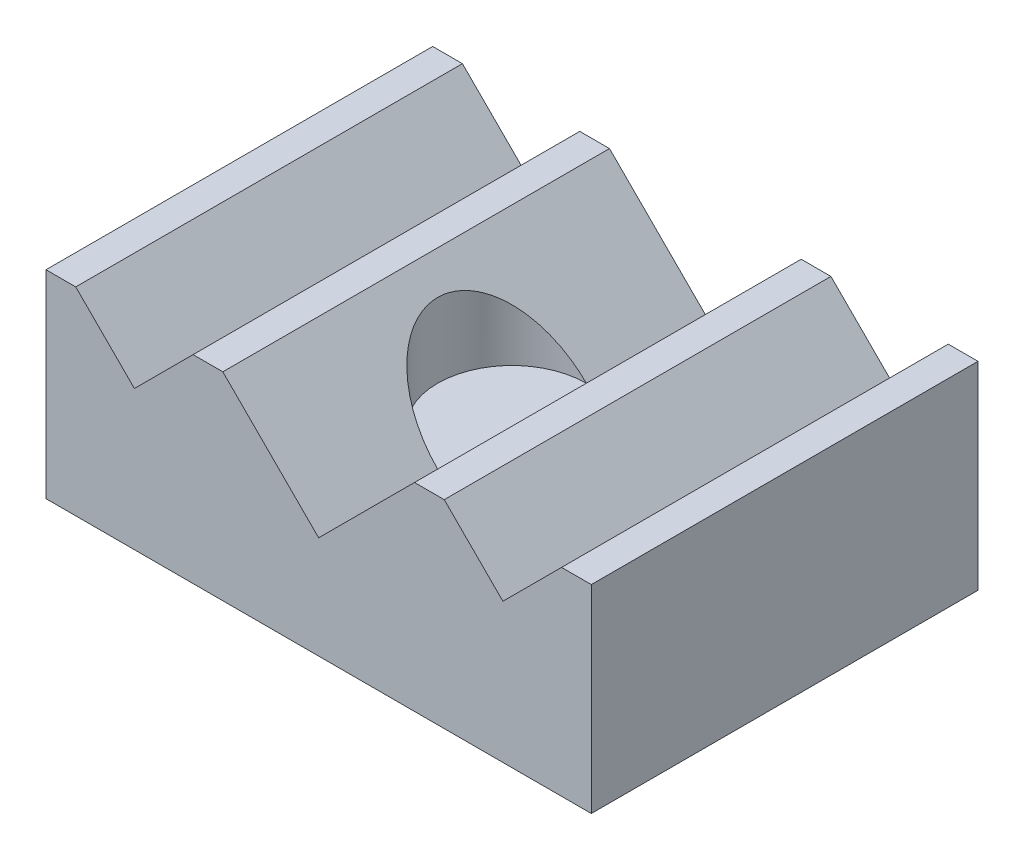
ISO-10303-21;
HEADER;
FILE_DESCRIPTION(('STEP AP214'),'2;1');
FILE_NAME('part.step','',(''),(''),'','','');
FILE_SCHEMA(('AUTOMOTIVE_DESIGN { 1 0 10303 214 1 1 1 1 }'));
ENDSEC;
DATA;
#1=APPLICATION_CONTEXT('core data for automotive mechanical design processes');
#2=APPLICATION_PROTOCOL_DEFINITION('international standard','automotive_design',2000,#1);
#3=PRODUCT_CONTEXT('',#1,'mechanical');
#4=PRODUCT('Part','Part','',(#3));
#5=PRODUCT_RELATED_PRODUCT_CATEGORY('part','',(#4));
#6=PRODUCT_DEFINITION_FORMATION('','',#4);
#7=PRODUCT_DEFINITION_CONTEXT('part definition',#1,'design');
#8=PRODUCT_DEFINITION('design','',#6,#7);
#9=PRODUCT_DEFINITION_SHAPE('','',#8);
#10=(LENGTH_UNIT() NAMED_UNIT(*) SI_UNIT(.MILLI.,.METRE.));
#11=(NAMED_UNIT(*) PLANE_ANGLE_UNIT() SI_UNIT($,.RADIAN.));
#12=(NAMED_UNIT(*) SI_UNIT($,.STERADIAN.) SOLID_ANGLE_UNIT());
#13=UNCERTAINTY_MEASURE_WITH_UNIT(LENGTH_MEASURE(1.E-05),#10,'distance_accuracy_value','');
#14=(GEOMETRIC_REPRESENTATION_CONTEXT(3) GLOBAL_UNCERTAINTY_ASSIGNED_CONTEXT((#13)) GLOBAL_UNIT_ASSIGNED_CONTEXT((#10,
#11,#12)) REPRESENTATION_CONTEXT('',''));
#15=CARTESIAN_POINT('',(0.,0.,0.));
#16=DIRECTION('',(0.,0.,1.));
#17=DIRECTION('',(1.,0.,0.));
#18=AXIS2_PLACEMENT_3D('',#15,#16,#17);
#19=CARTESIAN_POINT('',(7.20725,7.20725,-14.859));
#20=DIRECTION('',(-0.707106781186548,-0.707106781186548,0.));
#21=DIRECTION('',(0.707106781186548,-0.707106781186548,0.));
#22=AXIS2_PLACEMENT_3D('',#19,#20,#21);
#23=PLANE('',#22);
#24=CARTESIAN_POINT('',(10.4775,3.937,-7.4295));
#25=DIRECTION('',(-0.707106781186548,-0.707106781186548,0.));
#26=DIRECTION('',(0.707106781186548,-0.707106781186548,0.));
#27=AXIS2_PLACEMENT_3D('',#24,#25,#26);
#28=ELLIPSE('',#27,4.04111525448112,2.8575);
#29=CARTESIAN_POINT('',(10.4775,3.937,-10.287));
#30=VERTEX_POINT('',#29);
#31=CARTESIAN_POINT('',(10.4775,3.937,-4.572));
#32=VERTEX_POINT('',#31);
#33=EDGE_CURVE('E149',#30,#32,#28,.F.);
#34=ORIENTED_EDGE('',*,*,#33,.F.);
#35=DIRECTION('',(0.,0.,1.));
#36=VECTOR('',#35,1.);
#37=CARTESIAN_POINT('',(10.4775,3.937,-14.859));
#38=LINE('',#37,#36);
#39=CARTESIAN_POINT('',(10.4775,3.937,-14.859));
#40=VERTEX_POINT('',#39);
#41=EDGE_CURVE('E157',#40,#30,#38,.T.);
#42=ORIENTED_EDGE('',*,*,#41,.F.);
#43=DIRECTION('',(0.707106781186548,-0.707106781186548,0.));
#44=VECTOR('',#43,1.);
#45=CARTESIAN_POINT('',(7.20725,7.20725,-14.859));
#46=LINE('',#45,#44);
#47=CARTESIAN_POINT('',(6.7945,7.62,-14.859));
#48=VERTEX_POINT('',#47);
#49=EDGE_CURVE('E297',#48,#40,#46,.T.);
#50=ORIENTED_EDGE('',*,*,#49,.F.);
#51=DIRECTION('',(0.,0.,1.));
#52=VECTOR('',#51,1.);
#53=CARTESIAN_POINT('',(6.7945,7.62,-14.859));
#54=LINE('',#53,#52);
#55=CARTESIAN_POINT('',(6.7945,7.62,0.));
#56=VERTEX_POINT('',#55);
#57=EDGE_CURVE('E174',#48,#56,#54,.T.);
#58=ORIENTED_EDGE('',*,*,#57,.T.);
#59=DIRECTION('',(0.707106781186548,-0.707106781186548,0.));
#60=VECTOR('',#59,1.);
#61=CARTESIAN_POINT('',(7.20725,7.20725,0.));
#62=LINE('',#61,#60);
#63=CARTESIAN_POINT('',(10.4775,3.937,0.));
#64=VERTEX_POINT('',#63);
#65=EDGE_CURVE('E195',#56,#64,#62,.T.);
#66=ORIENTED_EDGE('',*,*,#65,.T.);
#67=EDGE_CURVE('E160',#32,#64,#38,.T.);
#68=ORIENTED_EDGE('',*,*,#67,.F.);
#69=EDGE_LOOP('',(#34,#42,#50,#58,#66,#68));
#70=FACE_BOUND('',#69,.T.);
#71=ADVANCED_FACE('F40',(#70),#23,.F.);
#72=CARTESIAN_POINT('',(3.27025,-3.27025,-14.859));
#73=DIRECTION('',(0.707106781186548,-0.707106781186547,0.));
#74=DIRECTION('',(0.707106781186547,0.707106781186548,0.));
#75=AXIS2_PLACEMENT_3D('',#72,#73,#74);
#76=PLANE('',#75);
#77=CARTESIAN_POINT('',(10.4775,3.937,-7.4295));
#78=DIRECTION('',(0.707106781186548,-0.707106781186547,0.));
#79=DIRECTION('',(-0.707106781186547,-0.707106781186548,0.));
#80=AXIS2_PLACEMENT_3D('',#77,#78,#79);
#81=ELLIPSE('',#80,4.04111525448112,2.8575);
#82=EDGE_CURVE('E11',#32,#30,#81,.F.);
#83=ORIENTED_EDGE('',*,*,#82,.F.);
#84=ORIENTED_EDGE('',*,*,#67,.T.);
#85=DIRECTION('',(0.707106781186547,0.707106781186548,0.));
#86=VECTOR('',#85,1.);
#87=CARTESIAN_POINT('',(3.27025,-3.27025,0.));
#88=LINE('',#87,#86);
#89=CARTESIAN_POINT('',(14.1605,7.62,0.));
#90=VERTEX_POINT('',#89);
#91=EDGE_CURVE('E293',#64,#90,#88,.T.);
#92=ORIENTED_EDGE('',*,*,#91,.T.);
#93=DIRECTION('',(0.,0.,1.));
#94=VECTOR('',#93,1.);
#95=CARTESIAN_POINT('',(14.1605,7.62,-14.859));
#96=LINE('',#95,#94);
#97=CARTESIAN_POINT('',(14.1605,7.62,-14.859));
#98=VERTEX_POINT('',#97);
#99=EDGE_CURVE('E169',#98,#90,#96,.T.);
#100=ORIENTED_EDGE('',*,*,#99,.F.);
#101=DIRECTION('',(0.707106781186547,0.707106781186548,0.));
#102=VECTOR('',#101,1.);
#103=CARTESIAN_POINT('',(3.27025,-3.27025,-14.859));
#104=LINE('',#103,#102);
#105=EDGE_CURVE('E166',#40,#98,#104,.T.);
#106=ORIENTED_EDGE('',*,*,#105,.F.);
#107=ORIENTED_EDGE('',*,*,#41,.T.);
#108=EDGE_LOOP('',(#83,#84,#92,#100,#106,#107));
#109=FACE_BOUND('',#108,.T.);
#110=ADVANCED_FACE('F164',(#109),#76,.F.);
#111=CARTESIAN_POINT('',(0.,7.62,0.));
#112=DIRECTION('',(0.,-1.,0.));
#113=DIRECTION('',(0.,0.,-1.));
#114=AXIS2_PLACEMENT_3D('',#111,#112,#113);
#115=PLANE('',#114);
#116=DIRECTION('',(1.,0.,0.));
#117=VECTOR('',#116,1.);
#118=CARTESIAN_POINT('',(0.,7.62,0.));
#119=LINE('',#118,#117);
#120=CARTESIAN_POINT('',(0.,7.62,0.));
#121=VERTEX_POINT('',#120);
#122=CARTESIAN_POINT('',(1.143,7.62,0.));
#123=VERTEX_POINT('',#122);
#124=EDGE_CURVE('E207',#121,#123,#119,.T.);
#125=ORIENTED_EDGE('',*,*,#124,.T.);
#126=DIRECTION('',(0.,0.,1.));
#127=VECTOR('',#126,1.);
#128=CARTESIAN_POINT('',(1.143,7.62,-14.859));
#129=LINE('',#128,#127);
#130=CARTESIAN_POINT('',(1.143,7.62,-14.859));
#131=VERTEX_POINT('',#130);
#132=EDGE_CURVE('E227',#131,#123,#129,.T.);
#133=ORIENTED_EDGE('',*,*,#132,.F.);
#134=DIRECTION('',(-1.,0.,0.));
#135=VECTOR('',#134,1.);
#136=CARTESIAN_POINT('',(0.,7.62,-14.859));
#137=LINE('',#136,#135);
#138=CARTESIAN_POINT('',(0.,7.62,-14.859));
#139=VERTEX_POINT('',#138);
#140=EDGE_CURVE('E215',#131,#139,#137,.T.);
#141=ORIENTED_EDGE('',*,*,#140,.T.);
#142=DIRECTION('',(0.,0.,1.));
#143=VECTOR('',#142,1.);
#144=CARTESIAN_POINT('',(0.,7.62,0.));
#145=LINE('',#144,#143);
#146=EDGE_CURVE('E201',#139,#121,#145,.T.);
#147=ORIENTED_EDGE('',*,*,#146,.T.);
#148=EDGE_LOOP('',(#125,#133,#141,#147));
#149=FACE_BOUND('',#148,.T.);
#150=ADVANCED_FACE('F331',(#149),#115,.F.);
#151=CARTESIAN_POINT('',(5.6515,7.62,-14.859));
#152=VERTEX_POINT('',#151);
#153=EDGE_CURVE('E326',#48,#152,#137,.T.);
#154=ORIENTED_EDGE('',*,*,#153,.T.);
#155=DIRECTION('',(0.,0.,1.));
#156=VECTOR('',#155,1.);
#157=CARTESIAN_POINT('',(5.6515,7.62,-14.859));
#158=LINE('',#157,#156);
#159=CARTESIAN_POINT('',(5.6515,7.62,0.));
#160=VERTEX_POINT('',#159);
#161=EDGE_CURVE('E289',#152,#160,#158,.T.);
#162=ORIENTED_EDGE('',*,*,#161,.T.);
#163=EDGE_CURVE('E212',#160,#56,#119,.T.);
#164=ORIENTED_EDGE('',*,*,#163,.T.);
#165=ORIENTED_EDGE('',*,*,#57,.F.);
#166=EDGE_LOOP('',(#154,#162,#164,#165));
#167=FACE_BOUND('',#166,.T.);
#168=ADVANCED_FACE('F287',(#167),#115,.F.);
#169=CARTESIAN_POINT('',(15.3035,7.62,-14.859));
#170=VERTEX_POINT('',#169);
#171=EDGE_CURVE('E221',#170,#98,#137,.T.);
#172=ORIENTED_EDGE('',*,*,#171,.T.);
#173=ORIENTED_EDGE('',*,*,#99,.T.);
#174=CARTESIAN_POINT('',(15.3035,7.62,0.));
#175=VERTEX_POINT('',#174);
#176=EDGE_CURVE('E274',#90,#175,#119,.T.);
#177=ORIENTED_EDGE('',*,*,#176,.T.);
#178=DIRECTION('',(0.,0.,1.));
#179=VECTOR('',#178,1.);
#180=CARTESIAN_POINT('',(15.3035,7.62,-14.859));
#181=LINE('',#180,#179);
#182=EDGE_CURVE('E192',#170,#175,#181,.T.);
#183=ORIENTED_EDGE('',*,*,#182,.F.);
#184=EDGE_LOOP('',(#172,#173,#177,#183));
#185=FACE_BOUND('',#184,.T.);
#186=ADVANCED_FACE('F324',(#185),#115,.F.);
#187=CARTESIAN_POINT('',(0.,7.62,0.));
#188=DIRECTION('',(1.,0.,0.));
#189=DIRECTION('',(0.,0.,-1.));
#190=AXIS2_PLACEMENT_3D('',#187,#188,#189);
#191=PLANE('',#190);
#192=DIRECTION('',(0.,0.,1.));
#193=VECTOR('',#192,1.);
#194=CARTESIAN_POINT('',(0.,0.,0.));
#195=LINE('',#194,#193);
#196=CARTESIAN_POINT('',(0.,0.,-14.859));
#197=VERTEX_POINT('',#196);
#198=CARTESIAN_POINT('',(0.,0.,0.));
#199=VERTEX_POINT('',#198);
#200=EDGE_CURVE('E222',#197,#199,#195,.T.);
#201=ORIENTED_EDGE('',*,*,#200,.T.);
#202=DIRECTION('',(0.,-1.,0.));
#203=VECTOR('',#202,1.);
#204=CARTESIAN_POINT('',(0.,7.62,0.));
#205=LINE('',#204,#203);
#206=EDGE_CURVE('E49',#121,#199,#205,.T.);
#207=ORIENTED_EDGE('',*,*,#206,.F.);
#208=ORIENTED_EDGE('',*,*,#146,.F.);
#209=DIRECTION('',(0.,-1.,0.));
#210=VECTOR('',#209,1.);
#211=CARTESIAN_POINT('',(0.,7.62,-14.859));
#212=LINE('',#211,#210);
#213=EDGE_CURVE('E220',#139,#197,#212,.T.);
#214=ORIENTED_EDGE('',*,*,#213,.T.);
#215=EDGE_LOOP('',(#201,#207,#208,#214));
#216=FACE_BOUND('',#215,.T.);
#217=ADVANCED_FACE('F42',(#216),#191,.F.);
#218=CARTESIAN_POINT('',(0.,7.62,0.));
#219=DIRECTION('',(0.,0.,-1.));
#220=DIRECTION('',(-1.,0.,0.));
#221=AXIS2_PLACEMENT_3D('',#218,#219,#220);
#222=PLANE('',#221);
#223=DIRECTION('',(0.707106781186548,0.707106781186548,0.));
#224=VECTOR('',#223,1.);
#225=CARTESIAN_POINT('',(-0.98425,0.98425,0.));
#226=LINE('',#225,#224);
#227=CARTESIAN_POINT('',(3.39725,5.36575,0.));
#228=VERTEX_POINT('',#227);
#229=EDGE_CURVE('E291',#228,#160,#226,.T.);
#230=ORIENTED_EDGE('',*,*,#229,.F.);
#231=DIRECTION('',(0.707106781186548,-0.707106781186547,0.));
#232=VECTOR('',#231,1.);
#233=CARTESIAN_POINT('',(4.3815,4.3815,0.));
#234=LINE('',#233,#232);
#235=EDGE_CURVE('E302',#123,#228,#234,.T.);
#236=ORIENTED_EDGE('',*,*,#235,.F.);
#237=ORIENTED_EDGE('',*,*,#124,.F.);
#238=ORIENTED_EDGE('',*,*,#206,.T.);
#239=DIRECTION('',(1.,0.,0.));
#240=VECTOR('',#239,1.);
#241=CARTESIAN_POINT('',(0.,0.,0.));
#242=LINE('',#241,#240);
#243=CARTESIAN_POINT('',(20.955,0.,0.));
#244=VERTEX_POINT('',#243);
#245=EDGE_CURVE('E226',#199,#244,#242,.T.);
#246=ORIENTED_EDGE('',*,*,#245,.T.);
#247=DIRECTION('',(0.,-1.,0.));
#248=VECTOR('',#247,1.);
#249=CARTESIAN_POINT('',(20.955,7.62,0.));
#250=LINE('',#249,#248);
#251=CARTESIAN_POINT('',(20.955,7.62,0.));
#252=VERTEX_POINT('',#251);
#253=EDGE_CURVE('E242',#252,#244,#250,.T.);
#254=ORIENTED_EDGE('',*,*,#253,.F.);
#255=CARTESIAN_POINT('',(19.812,7.62,0.));
#256=VERTEX_POINT('',#255);
#257=EDGE_CURVE('E205',#256,#252,#119,.T.);
#258=ORIENTED_EDGE('',*,*,#257,.F.);
#259=DIRECTION('',(0.707106781186548,0.707106781186548,0.));
#260=VECTOR('',#259,1.);
#261=CARTESIAN_POINT('',(6.096,-6.096,0.));
#262=LINE('',#261,#260);
#263=CARTESIAN_POINT('',(17.55775,5.36575,0.));
#264=VERTEX_POINT('',#263);
#265=EDGE_CURVE('E62',#264,#256,#262,.T.);
#266=ORIENTED_EDGE('',*,*,#265,.F.);
#267=DIRECTION('',(0.707106781186548,-0.707106781186548,0.));
#268=VECTOR('',#267,1.);
#269=CARTESIAN_POINT('',(11.46175,11.46175,0.));
#270=LINE('',#269,#268);
#271=EDGE_CURVE('E162',#175,#264,#270,.T.);
#272=ORIENTED_EDGE('',*,*,#271,.F.);
#273=ORIENTED_EDGE('',*,*,#176,.F.);
#274=ORIENTED_EDGE('',*,*,#91,.F.);
#275=ORIENTED_EDGE('',*,*,#65,.F.);
#276=ORIENTED_EDGE('',*,*,#163,.F.);
#277=EDGE_LOOP('',(#230,#236,#237,#238,#246,#254,#258,#266,#272,#273,#274,#275,#276));
#278=FACE_BOUND('',#277,.T.);
#279=ADVANCED_FACE('F250',(#278),#222,.F.);
#280=CARTESIAN_POINT('',(20.955,7.62,0.));
#281=DIRECTION('',(-1.,0.,0.));
#282=DIRECTION('',(0.,0.,1.));
#283=AXIS2_PLACEMENT_3D('',#280,#281,#282);
#284=PLANE('',#283);
#285=DIRECTION('',(0.,0.,-1.));
#286=VECTOR('',#285,1.);
#287=CARTESIAN_POINT('',(20.955,0.,0.));
#288=LINE('',#287,#286);
#289=CARTESIAN_POINT('',(20.955,0.,-14.859));
#290=VERTEX_POINT('',#289);
#291=EDGE_CURVE('E230',#244,#290,#288,.T.);
#292=ORIENTED_EDGE('',*,*,#291,.T.);
#293=DIRECTION('',(0.,-1.,0.));
#294=VECTOR('',#293,1.);
#295=CARTESIAN_POINT('',(20.955,7.62,-14.859));
#296=LINE('',#295,#294);
#297=CARTESIAN_POINT('',(20.955,7.62,-14.859));
#298=VERTEX_POINT('',#297);
#299=EDGE_CURVE('E238',#298,#290,#296,.T.);
#300=ORIENTED_EDGE('',*,*,#299,.F.);
#301=DIRECTION('',(0.,0.,-1.));
#302=VECTOR('',#301,1.);
#303=CARTESIAN_POINT('',(20.955,7.62,0.));
#304=LINE('',#303,#302);
#305=EDGE_CURVE('E211',#252,#298,#304,.T.);
#306=ORIENTED_EDGE('',*,*,#305,.F.);
#307=ORIENTED_EDGE('',*,*,#253,.T.);
#308=EDGE_LOOP('',(#292,#300,#306,#307));
#309=FACE_BOUND('',#308,.T.);
#310=ADVANCED_FACE('F263',(#309),#284,.F.);
#311=CARTESIAN_POINT('',(0.,7.62,-14.859));
#312=DIRECTION('',(0.,0.,1.));
#313=DIRECTION('',(1.,0.,0.));
#314=AXIS2_PLACEMENT_3D('',#311,#312,#313);
#315=PLANE('',#314);
#316=ORIENTED_EDGE('',*,*,#140,.F.);
#317=DIRECTION('',(0.707106781186548,-0.707106781186547,0.));
#318=VECTOR('',#317,1.);
#319=CARTESIAN_POINT('',(4.3815,4.3815,-14.859));
#320=LINE('',#319,#318);
#321=CARTESIAN_POINT('',(3.39725,5.36575,-14.859));
#322=VERTEX_POINT('',#321);
#323=EDGE_CURVE('E308',#131,#322,#320,.T.);
#324=ORIENTED_EDGE('',*,*,#323,.T.);
#325=DIRECTION('',(0.707106781186548,0.707106781186548,0.));
#326=VECTOR('',#325,1.);
#327=CARTESIAN_POINT('',(-0.98425,0.98425,-14.859));
#328=LINE('',#327,#326);
#329=EDGE_CURVE('E311',#322,#152,#328,.T.);
#330=ORIENTED_EDGE('',*,*,#329,.T.);
#331=ORIENTED_EDGE('',*,*,#153,.F.);
#332=ORIENTED_EDGE('',*,*,#49,.T.);
#333=ORIENTED_EDGE('',*,*,#105,.T.);
#334=ORIENTED_EDGE('',*,*,#171,.F.);
#335=DIRECTION('',(0.707106781186548,-0.707106781186548,0.));
#336=VECTOR('',#335,1.);
#337=CARTESIAN_POINT('',(11.46175,11.46175,-14.859));
#338=LINE('',#337,#336);
#339=CARTESIAN_POINT('',(17.55775,5.36575,-14.859));
#340=VERTEX_POINT('',#339);
#341=EDGE_CURVE('E178',#170,#340,#338,.T.);
#342=ORIENTED_EDGE('',*,*,#341,.T.);
#343=DIRECTION('',(0.707106781186548,0.707106781186548,0.));
#344=VECTOR('',#343,1.);
#345=CARTESIAN_POINT('',(6.096,-6.096,-14.859));
#346=LINE('',#345,#344);
#347=CARTESIAN_POINT('',(19.812,7.62,-14.859));
#348=VERTEX_POINT('',#347);
#349=EDGE_CURVE('E182',#340,#348,#346,.T.);
#350=ORIENTED_EDGE('',*,*,#349,.T.);
#351=EDGE_CURVE('E216',#298,#348,#137,.T.);
#352=ORIENTED_EDGE('',*,*,#351,.F.);
#353=ORIENTED_EDGE('',*,*,#299,.T.);
#354=DIRECTION('',(-1.,0.,0.));
#355=VECTOR('',#354,1.);
#356=CARTESIAN_POINT('',(0.,0.,-14.859));
#357=LINE('',#356,#355);
#358=EDGE_CURVE('E206',#290,#197,#357,.T.);
#359=ORIENTED_EDGE('',*,*,#358,.T.);
#360=ORIENTED_EDGE('',*,*,#213,.F.);
#361=EDGE_LOOP('',(#316,#324,#330,#331,#332,#333,#334,#342,#350,#352,#353,#359,#360));
#362=FACE_BOUND('',#361,.T.);
#363=ADVANCED_FACE('F268',(#362),#315,.F.);
#364=ORIENTED_EDGE('',*,*,#351,.T.);
#365=DIRECTION('',(0.,0.,1.));
#366=VECTOR('',#365,1.);
#367=CARTESIAN_POINT('',(19.812,7.62,-14.859));
#368=LINE('',#367,#366);
#369=EDGE_CURVE('E196',#348,#256,#368,.T.);
#370=ORIENTED_EDGE('',*,*,#369,.T.);
#371=ORIENTED_EDGE('',*,*,#257,.T.);
#372=ORIENTED_EDGE('',*,*,#305,.T.);
#373=EDGE_LOOP('',(#364,#370,#371,#372));
#374=FACE_BOUND('',#373,.T.);
#375=ADVANCED_FACE('F271',(#374),#115,.F.);
#376=CARTESIAN_POINT('',(0.,0.,0.));
#377=DIRECTION('',(0.,-1.,0.));
#378=DIRECTION('',(0.,0.,-1.));
#379=AXIS2_PLACEMENT_3D('',#376,#377,#378);
#380=PLANE('',#379);
#381=CARTESIAN_POINT('',(16.9164,0.,-3.7846));
#382=DIRECTION('',(0.,-1.,0.));
#383=DIRECTION('',(0.,0.,-1.));
#384=AXIS2_PLACEMENT_3D('',#381,#382,#383);
#385=CIRCLE('',#384,0.927100000000001);
#386=CARTESIAN_POINT('',(16.9164,0.,-4.7117));
#387=VERTEX_POINT('',#386);
#388=EDGE_CURVE('E346',#387,#387,#385,.T.);
#389=ORIENTED_EDGE('',*,*,#388,.F.);
#390=EDGE_LOOP('',(#389));
#391=FACE_BOUND('',#390,.T.);
#392=CARTESIAN_POINT('',(16.9164,0.,-11.0744));
#393=DIRECTION('',(0.,-1.,0.));
#394=DIRECTION('',(0.,0.,-1.));
#395=AXIS2_PLACEMENT_3D('',#392,#393,#394);
#396=CIRCLE('',#395,0.927100000000001);
#397=CARTESIAN_POINT('',(16.9164,0.,-12.0015));
#398=VERTEX_POINT('',#397);
#399=EDGE_CURVE('E354',#398,#398,#396,.T.);
#400=ORIENTED_EDGE('',*,*,#399,.F.);
#401=EDGE_LOOP('',(#400));
#402=FACE_BOUND('',#401,.T.);
#403=CARTESIAN_POINT('',(10.4775,0.,-7.4295));
#404=DIRECTION('',(0.,-1.,0.));
#405=DIRECTION('',(0.,0.,-1.));
#406=AXIS2_PLACEMENT_3D('',#403,#404,#405);
#407=CIRCLE('',#406,0.927100000000001);
#408=CARTESIAN_POINT('',(10.4775,0.,-8.3566));
#409=VERTEX_POINT('',#408);
#410=EDGE_CURVE('E362',#409,#409,#407,.T.);
#411=ORIENTED_EDGE('',*,*,#410,.F.);
#412=EDGE_LOOP('',(#411));
#413=FACE_BOUND('',#412,.T.);
#414=CARTESIAN_POINT('',(4.0386,0.,-11.0744));
#415=DIRECTION('',(0.,-1.,0.));
#416=DIRECTION('',(0.,0.,-1.));
#417=AXIS2_PLACEMENT_3D('',#414,#415,#416);
#418=CIRCLE('',#417,0.9271);
#419=CARTESIAN_POINT('',(4.0386,0.,-12.0015));
#420=VERTEX_POINT('',#419);
#421=EDGE_CURVE('E370',#420,#420,#418,.T.);
#422=ORIENTED_EDGE('',*,*,#421,.F.);
#423=EDGE_LOOP('',(#422));
#424=FACE_BOUND('',#423,.T.);
#425=CARTESIAN_POINT('',(4.0386,0.,-3.7846));
#426=DIRECTION('',(0.,-1.,0.));
#427=DIRECTION('',(0.,0.,-1.));
#428=AXIS2_PLACEMENT_3D('',#425,#426,#427);
#429=CIRCLE('',#428,0.9271);
#430=CARTESIAN_POINT('',(4.0386,0.,-4.7117));
#431=VERTEX_POINT('',#430);
#432=EDGE_CURVE('E338',#431,#431,#429,.T.);
#433=ORIENTED_EDGE('',*,*,#432,.F.);
#434=EDGE_LOOP('',(#433));
#435=FACE_BOUND('',#434,.T.);
#436=ORIENTED_EDGE('',*,*,#200,.F.);
#437=ORIENTED_EDGE('',*,*,#358,.F.);
#438=ORIENTED_EDGE('',*,*,#291,.F.);
#439=ORIENTED_EDGE('',*,*,#245,.F.);
#440=EDGE_LOOP('',(#436,#437,#438,#439));
#441=FACE_BOUND('',#440,.T.);
#442=ADVANCED_FACE('F259',(#391,#402,#413,#424,#435,#441),#380,.T.);
#443=CARTESIAN_POINT('',(11.46175,11.46175,-14.859));
#444=DIRECTION('',(-0.707106781186548,-0.707106781186548,0.));
#445=DIRECTION('',(0.707106781186548,-0.707106781186548,0.));
#446=AXIS2_PLACEMENT_3D('',#443,#444,#445);
#447=PLANE('',#446);
#448=ORIENTED_EDGE('',*,*,#271,.T.);
#449=DIRECTION('',(0.,0.,1.));
#450=VECTOR('',#449,1.);
#451=CARTESIAN_POINT('',(17.55775,5.36575,-14.859));
#452=LINE('',#451,#450);
#453=EDGE_CURVE('E186',#340,#264,#452,.T.);
#454=ORIENTED_EDGE('',*,*,#453,.F.);
#455=ORIENTED_EDGE('',*,*,#341,.F.);
#456=ORIENTED_EDGE('',*,*,#182,.T.);
#457=EDGE_LOOP('',(#448,#454,#455,#456));
#458=FACE_BOUND('',#457,.T.);
#459=ADVANCED_FACE('F389',(#458),#447,.F.);
#460=CARTESIAN_POINT('',(6.096,-6.096,-14.859));
#461=DIRECTION('',(0.707106781186548,-0.707106781186548,0.));
#462=DIRECTION('',(0.707106781186548,0.707106781186548,0.));
#463=AXIS2_PLACEMENT_3D('',#460,#461,#462);
#464=PLANE('',#463);
#465=ORIENTED_EDGE('',*,*,#265,.T.);
#466=ORIENTED_EDGE('',*,*,#369,.F.);
#467=ORIENTED_EDGE('',*,*,#349,.F.);
#468=ORIENTED_EDGE('',*,*,#453,.T.);
#469=EDGE_LOOP('',(#465,#466,#467,#468));
#470=FACE_BOUND('',#469,.T.);
#471=ADVANCED_FACE('F415',(#470),#464,.F.);
#472=CARTESIAN_POINT('',(4.3815,4.3815,-14.859));
#473=DIRECTION('',(-0.707106781186547,-0.707106781186548,0.));
#474=DIRECTION('',(0.707106781186548,-0.707106781186547,0.));
#475=AXIS2_PLACEMENT_3D('',#472,#473,#474);
#476=PLANE('',#475);
#477=ORIENTED_EDGE('',*,*,#235,.T.);
#478=DIRECTION('',(0.,0.,1.));
#479=VECTOR('',#478,1.);
#480=CARTESIAN_POINT('',(3.39725,5.36575,-14.859));
#481=LINE('',#480,#479);
#482=EDGE_CURVE('E318',#322,#228,#481,.T.);
#483=ORIENTED_EDGE('',*,*,#482,.F.);
#484=ORIENTED_EDGE('',*,*,#323,.F.);
#485=ORIENTED_EDGE('',*,*,#132,.T.);
#486=EDGE_LOOP('',(#477,#483,#484,#485));
#487=FACE_BOUND('',#486,.T.);
#488=ADVANCED_FACE('F418',(#487),#476,.F.);
#489=CARTESIAN_POINT('',(-0.98425,0.98425,-14.859));
#490=DIRECTION('',(0.707106781186548,-0.707106781186548,0.));
#491=DIRECTION('',(0.707106781186548,0.707106781186548,0.));
#492=AXIS2_PLACEMENT_3D('',#489,#490,#491);
#493=PLANE('',#492);
#494=ORIENTED_EDGE('',*,*,#229,.T.);
#495=ORIENTED_EDGE('',*,*,#161,.F.);
#496=ORIENTED_EDGE('',*,*,#329,.F.);
#497=ORIENTED_EDGE('',*,*,#482,.T.);
#498=EDGE_LOOP('',(#494,#495,#496,#497));
#499=FACE_BOUND('',#498,.T.);
#500=ADVANCED_FACE('F492',(#499),#493,.F.);
#501=CARTESIAN_POINT('',(10.4775,7.62,-7.4295));
#502=DIRECTION('',(0.,-1.,0.));
#503=DIRECTION('',(0.,0.,-1.));
#504=AXIS2_PLACEMENT_3D('',#501,#502,#503);
#505=CYLINDRICAL_SURFACE('',#504,2.8575);
#506=ORIENTED_EDGE('',*,*,#33,.T.);
#507=CARTESIAN_POINT('',(10.4775,3.937,-7.4295));
#508=DIRECTION('',(0.,1.,0.));
#509=DIRECTION('',(0.,0.,1.));
#510=AXIS2_PLACEMENT_3D('',#507,#508,#509);
#511=CIRCLE('',#510,2.8575);
#512=EDGE_CURVE('E146',#30,#32,#511,.T.);
#513=ORIENTED_EDGE('',*,*,#512,.F.);
#514=EDGE_LOOP('',(#506,#513));
#515=FACE_BOUND('',#514,.T.);
#516=ADVANCED_FACE('F147',(#515),#505,.F.);
#517=ORIENTED_EDGE('',*,*,#82,.T.);
#518=EDGE_CURVE('E54',#32,#30,#511,.T.);
#519=ORIENTED_EDGE('',*,*,#518,.F.);
#520=EDGE_LOOP('',(#517,#519));
#521=FACE_BOUND('',#520,.T.);
#522=ADVANCED_FACE('F140',(#521),#505,.F.);
#523=CARTESIAN_POINT('',(10.4775,3.937,-7.4295));
#524=DIRECTION('',(0.,1.,0.));
#525=DIRECTION('',(0.,0.,1.));
#526=AXIS2_PLACEMENT_3D('',#523,#524,#525);
#527=PLANE('',#526);
#528=ORIENTED_EDGE('',*,*,#518,.T.);
#529=ORIENTED_EDGE('',*,*,#512,.T.);
#530=EDGE_LOOP('',(#528,#529));
#531=FACE_BOUND('',#530,.T.);
#532=ADVANCED_FACE('F154',(#531),#527,.T.);
#533=CARTESIAN_POINT('',(4.0386,3.81,-3.7846));
#534=DIRECTION('',(0.,-1.,0.));
#535=DIRECTION('',(0.,0.,-1.));
#536=AXIS2_PLACEMENT_3D('',#533,#534,#535);
#537=CYLINDRICAL_SURFACE('',#536,0.9271);
#538=CARTESIAN_POINT('',(4.0386,3.81,-3.7846));
#539=DIRECTION('',(0.,-1.,0.));
#540=DIRECTION('',(0.,0.,-1.));
#541=AXIS2_PLACEMENT_3D('',#538,#539,#540);
#542=CIRCLE('',#541,0.9271);
#543=CARTESIAN_POINT('',(4.0386,3.81,-4.7117));
#544=VERTEX_POINT('',#543);
#545=EDGE_CURVE('E152',#544,#544,#542,.T.);
#546=ORIENTED_EDGE('',*,*,#545,.F.);
#547=EDGE_LOOP('',(#546));
#548=FACE_BOUND('',#547,.T.);
#549=ORIENTED_EDGE('',*,*,#432,.T.);
#550=EDGE_LOOP('',(#549));
#551=FACE_BOUND('',#550,.T.);
#552=ADVANCED_FACE('F394',(#548,#551),#537,.F.);
#553=CARTESIAN_POINT('',(0.,3.81,0.));
#554=DIRECTION('',(0.,-1.,0.));
#555=DIRECTION('',(0.,0.,-1.));
#556=AXIS2_PLACEMENT_3D('',#553,#554,#555);
#557=PLANE('',#556);
#558=ORIENTED_EDGE('',*,*,#545,.T.);
#559=EDGE_LOOP('',(#558));
#560=FACE_BOUND('',#559,.T.);
#561=ADVANCED_FACE('F383',(#560),#557,.T.);
#562=CARTESIAN_POINT('',(4.0386,3.81,-11.0744));
#563=DIRECTION('',(0.,-1.,0.));
#564=DIRECTION('',(0.,0.,-1.));
#565=AXIS2_PLACEMENT_3D('',#562,#563,#564);
#566=CYLINDRICAL_SURFACE('',#565,0.9271);
#567=CARTESIAN_POINT('',(4.0386,3.81,-11.0744));
#568=DIRECTION('',(0.,-1.,0.));
#569=DIRECTION('',(0.,0.,-1.));
#570=AXIS2_PLACEMENT_3D('',#567,#568,#569);
#571=CIRCLE('',#570,0.9271);
#572=CARTESIAN_POINT('',(4.0386,3.81,-12.0015));
#573=VERTEX_POINT('',#572);
#574=EDGE_CURVE('E342',#573,#573,#571,.T.);
#575=ORIENTED_EDGE('',*,*,#574,.F.);
#576=EDGE_LOOP('',(#575));
#577=FACE_BOUND('',#576,.T.);
#578=ORIENTED_EDGE('',*,*,#421,.T.);
#579=EDGE_LOOP('',(#578));
#580=FACE_BOUND('',#579,.T.);
#581=ADVANCED_FACE('F380',(#577,#580),#566,.F.);
#582=CARTESIAN_POINT('',(0.,3.81,0.));
#583=DIRECTION('',(0.,-1.,0.));
#584=DIRECTION('',(0.,0.,-1.));
#585=AXIS2_PLACEMENT_3D('',#582,#583,#584);
#586=PLANE('',#585);
#587=ORIENTED_EDGE('',*,*,#574,.T.);
#588=EDGE_LOOP('',(#587));
#589=FACE_BOUND('',#588,.T.);
#590=ADVANCED_FACE('F378',(#589),#586,.T.);
#591=CARTESIAN_POINT('',(10.4775,3.81,-7.4295));
#592=DIRECTION('',(0.,-1.,0.));
#593=DIRECTION('',(0.,0.,-1.));
#594=AXIS2_PLACEMENT_3D('',#591,#592,#593);
#595=CYLINDRICAL_SURFACE('',#594,0.927100000000001);
#596=CARTESIAN_POINT('',(10.4775,3.81,-7.4295));
#597=DIRECTION('',(0.,-1.,0.));
#598=DIRECTION('',(0.,0.,-1.));
#599=AXIS2_PLACEMENT_3D('',#596,#597,#598);
#600=CIRCLE('',#599,0.927100000000001);
#601=CARTESIAN_POINT('',(10.4775,3.81,-8.3566));
#602=VERTEX_POINT('',#601);
#603=EDGE_CURVE('E366',#602,#602,#600,.T.);
#604=ORIENTED_EDGE('',*,*,#603,.F.);
#605=EDGE_LOOP('',(#604));
#606=FACE_BOUND('',#605,.T.);
#607=ORIENTED_EDGE('',*,*,#410,.T.);
#608=EDGE_LOOP('',(#607));
#609=FACE_BOUND('',#608,.T.);
#610=ADVANCED_FACE('F553',(#606,#609),#595,.F.);
#611=CARTESIAN_POINT('',(0.,3.81,0.));
#612=DIRECTION('',(0.,-1.,0.));
#613=DIRECTION('',(0.,0.,-1.));
#614=AXIS2_PLACEMENT_3D('',#611,#612,#613);
#615=PLANE('',#614);
#616=ORIENTED_EDGE('',*,*,#603,.T.);
#617=EDGE_LOOP('',(#616));
#618=FACE_BOUND('',#617,.T.);
#619=ADVANCED_FACE('F562',(#618),#615,.T.);
#620=CARTESIAN_POINT('',(16.9164,3.81,-11.0744));
#621=DIRECTION('',(0.,-1.,0.));
#622=DIRECTION('',(0.,0.,-1.));
#623=AXIS2_PLACEMENT_3D('',#620,#621,#622);
#624=CYLINDRICAL_SURFACE('',#623,0.927100000000001);
#625=CARTESIAN_POINT('',(16.9164,3.81,-11.0744));
#626=DIRECTION('',(0.,-1.,0.));
#627=DIRECTION('',(0.,0.,-1.));
#628=AXIS2_PLACEMENT_3D('',#625,#626,#627);
#629=CIRCLE('',#628,0.927100000000001);
#630=CARTESIAN_POINT('',(16.9164,3.81,-12.0015));
#631=VERTEX_POINT('',#630);
#632=EDGE_CURVE('E358',#631,#631,#629,.T.);
#633=ORIENTED_EDGE('',*,*,#632,.F.);
#634=EDGE_LOOP('',(#633));
#635=FACE_BOUND('',#634,.T.);
#636=ORIENTED_EDGE('',*,*,#399,.T.);
#637=EDGE_LOOP('',(#636));
#638=FACE_BOUND('',#637,.T.);
#639=ADVANCED_FACE('F572',(#635,#638),#624,.F.);
#640=CARTESIAN_POINT('',(0.,3.81,0.));
#641=DIRECTION('',(0.,-1.,0.));
#642=DIRECTION('',(0.,0.,-1.));
#643=AXIS2_PLACEMENT_3D('',#640,#641,#642);
#644=PLANE('',#643);
#645=ORIENTED_EDGE('',*,*,#632,.T.);
#646=EDGE_LOOP('',(#645));
#647=FACE_BOUND('',#646,.T.);
#648=ADVANCED_FACE('F582',(#647),#644,.T.);
#649=CARTESIAN_POINT('',(16.9164,3.81,-3.7846));
#650=DIRECTION('',(0.,-1.,0.));
#651=DIRECTION('',(0.,0.,-1.));
#652=AXIS2_PLACEMENT_3D('',#649,#650,#651);
#653=CYLINDRICAL_SURFACE('',#652,0.927100000000001);
#654=CARTESIAN_POINT('',(16.9164,3.81,-3.7846));
#655=DIRECTION('',(0.,-1.,0.));
#656=DIRECTION('',(0.,0.,-1.));
#657=AXIS2_PLACEMENT_3D('',#654,#655,#656);
#658=CIRCLE('',#657,0.927100000000001);
#659=CARTESIAN_POINT('',(16.9164,3.81,-4.7117));
#660=VERTEX_POINT('',#659);
#661=EDGE_CURVE('E350',#660,#660,#658,.T.);
#662=ORIENTED_EDGE('',*,*,#661,.F.);
#663=EDGE_LOOP('',(#662));
#664=FACE_BOUND('',#663,.T.);
#665=ORIENTED_EDGE('',*,*,#388,.T.);
#666=EDGE_LOOP('',(#665));
#667=FACE_BOUND('',#666,.T.);
#668=ADVANCED_FACE('F592',(#664,#667),#653,.F.);
#669=CARTESIAN_POINT('',(0.,3.81,0.));
#670=DIRECTION('',(0.,-1.,0.));
#671=DIRECTION('',(0.,0.,-1.));
#672=AXIS2_PLACEMENT_3D('',#669,#670,#671);
#673=PLANE('',#672);
#674=ORIENTED_EDGE('',*,*,#661,.T.);
#675=EDGE_LOOP('',(#674));
#676=FACE_BOUND('',#675,.T.);
#677=ADVANCED_FACE('F602',(#676),#673,.T.);
#678=CLOSED_SHELL('',(#71,#110,#150,#168,#186,#217,#279,#310,#363,#375,#442,#459,#471,#488,#500,
#516,#522,#532,#552,#561,#581,#590,#610,#619,#639,#648,#668,#677));
#679=MANIFOLD_SOLID_BREP('B2',#678);
#680=ADVANCED_BREP_SHAPE_REPRESENTATION('',(#18,#679),#14);
#681=SHAPE_DEFINITION_REPRESENTATION(#9,#680);
ENDSEC;
END-ISO-10303-21;
